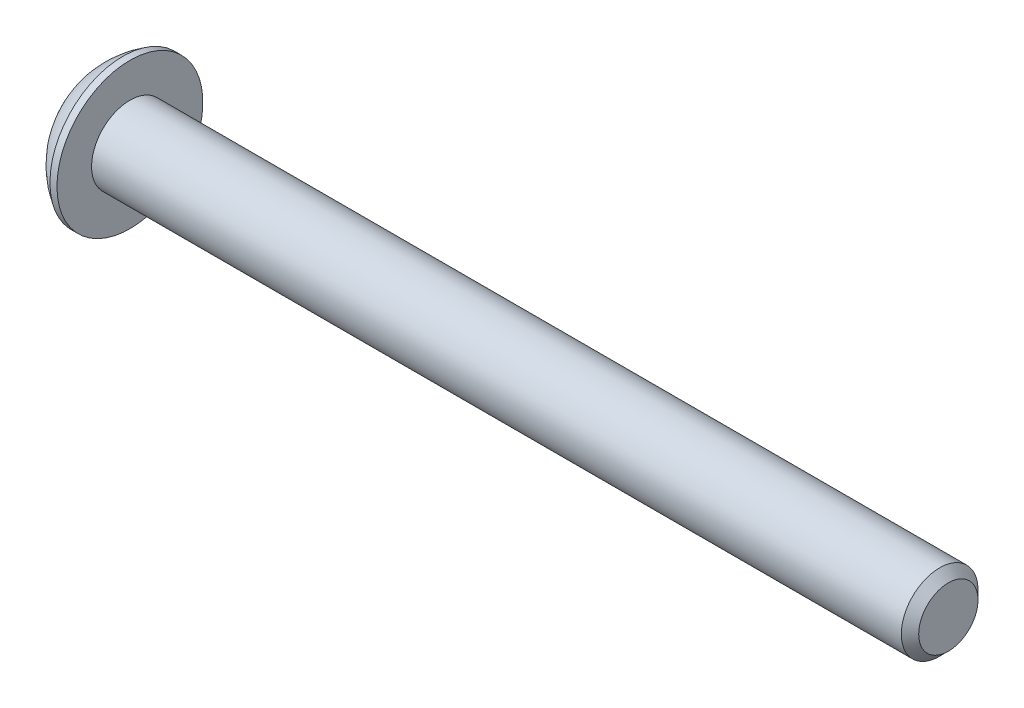
ISO-10303-21;
HEADER;
FILE_DESCRIPTION(('STEP AP214'),'2;1');
FILE_NAME('part.step','',(''),(''),'','','');
FILE_SCHEMA(('AUTOMOTIVE_DESIGN { 1 0 10303 214 1 1 1 1 }'));
ENDSEC;
DATA;
#1=APPLICATION_CONTEXT('core data for automotive mechanical design processes');
#2=APPLICATION_PROTOCOL_DEFINITION('international standard','automotive_design',2000,#1);
#3=PRODUCT_CONTEXT('',#1,'mechanical');
#4=PRODUCT('Part','Part','',(#3));
#5=PRODUCT_RELATED_PRODUCT_CATEGORY('part','',(#4));
#6=PRODUCT_DEFINITION_FORMATION('','',#4);
#7=PRODUCT_DEFINITION_CONTEXT('part definition',#1,'design');
#8=PRODUCT_DEFINITION('design','',#6,#7);
#9=PRODUCT_DEFINITION_SHAPE('','',#8);
#10=(LENGTH_UNIT() NAMED_UNIT(*) SI_UNIT(.MILLI.,.METRE.));
#11=(NAMED_UNIT(*) PLANE_ANGLE_UNIT() SI_UNIT($,.RADIAN.));
#12=(NAMED_UNIT(*) SI_UNIT($,.STERADIAN.) SOLID_ANGLE_UNIT());
#13=UNCERTAINTY_MEASURE_WITH_UNIT(LENGTH_MEASURE(1.E-05),#10,'distance_accuracy_value','');
#14=(GEOMETRIC_REPRESENTATION_CONTEXT(3) GLOBAL_UNCERTAINTY_ASSIGNED_CONTEXT((#13)) GLOBAL_UNIT_ASSIGNED_CONTEXT((#10,
#11,#12)) REPRESENTATION_CONTEXT('',''));
#15=CARTESIAN_POINT('',(0.,0.,0.));
#16=DIRECTION('',(0.,0.,1.));
#17=DIRECTION('',(1.,0.,0.));
#18=AXIS2_PLACEMENT_3D('',#15,#16,#17);
#19=CARTESIAN_POINT('',(1.32079999997359,0.,0.));
#20=DIRECTION('',(-1.,0.,0.));
#21=DIRECTION('',(0.,0.,1.));
#22=AXIS2_PLACEMENT_3D('',#19,#20,#21);
#23=CONICAL_SURFACE('',#22,1.19380000001001,1.04719755119008);
#24=CARTESIAN_POINT('',(2.0100407513155,0.,0.));
#25=VERTEX_POINT('',#24);
#26=VERTEX_LOOP('',#25);
#27=FACE_BOUND('',#26,.T.);
#28=CARTESIAN_POINT('',(1.32079999997359,0.,0.));
#29=DIRECTION('',(-1.,0.,0.));
#30=DIRECTION('',(0.,0.,1.));
#31=AXIS2_PLACEMENT_3D('',#28,#29,#30);
#32=CIRCLE('',#31,1.19380000001001);
#33=CARTESIAN_POINT('',(1.32079999998682,-1.0338611270422,0.596900000002503));
#34=VERTEX_POINT('',#33);
#35=CARTESIAN_POINT('',(1.32079999998682,0.,1.19380000000501));
#36=VERTEX_POINT('',#35);
#37=EDGE_CURVE('E92',#34,#36,#32,.T.);
#38=ORIENTED_EDGE('',*,*,#37,.T.);
#39=CARTESIAN_POINT('',(1.32079999997359,0.,0.));
#40=DIRECTION('',(-1.,0.,0.));
#41=DIRECTION('',(0.,0.,1.));
#42=AXIS2_PLACEMENT_3D('',#39,#40,#41);
#43=CIRCLE('',#42,1.19380000001001);
#44=CARTESIAN_POINT('',(1.32079999998682,1.0338611270422,0.596900000002504));
#45=VERTEX_POINT('',#44);
#46=EDGE_CURVE('E88',#36,#45,#43,.T.);
#47=ORIENTED_EDGE('',*,*,#46,.T.);
#48=CARTESIAN_POINT('',(1.32079999997359,0.,0.));
#49=DIRECTION('',(-1.,0.,0.));
#50=DIRECTION('',(0.,0.,1.));
#51=AXIS2_PLACEMENT_3D('',#48,#49,#50);
#52=CIRCLE('',#51,1.19380000001001);
#53=CARTESIAN_POINT('',(1.32079999998682,1.0338611270422,-0.596900000002504));
#54=VERTEX_POINT('',#53);
#55=EDGE_CURVE('E21',#45,#54,#52,.T.);
#56=ORIENTED_EDGE('',*,*,#55,.T.);
#57=CARTESIAN_POINT('',(1.32079999997359,0.,0.));
#58=DIRECTION('',(-1.,0.,0.));
#59=DIRECTION('',(0.,0.,1.));
#60=AXIS2_PLACEMENT_3D('',#57,#58,#59);
#61=CIRCLE('',#60,1.19380000001001);
#62=CARTESIAN_POINT('',(1.32079999998682,1.49461108489558E-12,-1.19380000000501));
#63=VERTEX_POINT('',#62);
#64=EDGE_CURVE('E151',#54,#63,#61,.T.);
#65=ORIENTED_EDGE('',*,*,#64,.T.);
#66=CARTESIAN_POINT('',(1.32079999997359,0.,0.));
#67=DIRECTION('',(-1.,0.,0.));
#68=DIRECTION('',(0.,0.,1.));
#69=AXIS2_PLACEMENT_3D('',#66,#67,#68);
#70=CIRCLE('',#69,1.19380000001001);
#71=CARTESIAN_POINT('',(1.32079999998682,-1.0338611270422,-0.596900000002503));
#72=VERTEX_POINT('',#71);
#73=EDGE_CURVE('E153',#63,#72,#70,.T.);
#74=ORIENTED_EDGE('',*,*,#73,.T.);
#75=CARTESIAN_POINT('',(1.32079999997359,0.,0.));
#76=DIRECTION('',(-1.,0.,0.));
#77=DIRECTION('',(0.,0.,1.));
#78=AXIS2_PLACEMENT_3D('',#75,#76,#77);
#79=CIRCLE('',#78,1.19380000001001);
#80=EDGE_CURVE('E155',#72,#34,#79,.T.);
#81=ORIENTED_EDGE('',*,*,#80,.T.);
#82=EDGE_LOOP('',(#38,#47,#56,#65,#74,#81));
#83=FACE_BOUND('',#82,.T.);
#84=ADVANCED_FACE('F17',(#27,#83),#23,.F.);
#85=CARTESIAN_POINT('',(1.3208,-2.06772225407572,-1.1938));
#86=DIRECTION('',(1.,0.,0.));
#87=DIRECTION('',(0.,0.,-1.));
#88=AXIS2_PLACEMENT_3D('',#85,#86,#87);
#89=PLANE('',#88);
#90=DIRECTION('',(0.,-0.5,-0.866025403784439));
#91=VECTOR('',#90,1.);
#92=CARTESIAN_POINT('',(1.32080000000004,1.37848150271715,0.));
#93=LINE('',#92,#91);
#94=CARTESIAN_POINT('',(1.32080000000001,1.37848150271715,0.));
#95=VERTEX_POINT('',#94);
#96=EDGE_CURVE('E104',#54,#95,#93,.F.);
#97=ORIENTED_EDGE('',*,*,#96,.F.);
#98=ORIENTED_EDGE('',*,*,#55,.F.);
#99=DIRECTION('',(0.,0.5,-0.866025403784439));
#100=VECTOR('',#99,1.);
#101=CARTESIAN_POINT('',(1.3208,0.689240751358576,1.1938));
#102=LINE('',#101,#100);
#103=EDGE_CURVE('E102',#95,#45,#102,.F.);
#104=ORIENTED_EDGE('',*,*,#103,.F.);
#105=EDGE_LOOP('',(#97,#98,#104));
#106=FACE_BOUND('',#105,.T.);
#107=ADVANCED_FACE('F100',(#106),#89,.F.);
#108=CARTESIAN_POINT('',(1.3208,-2.06772225407572,-1.1938));
#109=DIRECTION('',(1.,0.,0.));
#110=DIRECTION('',(0.,0.,-1.));
#111=AXIS2_PLACEMENT_3D('',#108,#109,#110);
#112=PLANE('',#111);
#113=DIRECTION('',(0.,0.5,-0.866025403784439));
#114=VECTOR('',#113,1.);
#115=CARTESIAN_POINT('',(1.32080000000004,0.689240751358576,1.1938));
#116=LINE('',#115,#114);
#117=CARTESIAN_POINT('',(1.32080000000001,0.689240751358576,1.1938));
#118=VERTEX_POINT('',#117);
#119=EDGE_CURVE('E106',#45,#118,#116,.F.);
#120=ORIENTED_EDGE('',*,*,#119,.F.);
#121=ORIENTED_EDGE('',*,*,#46,.F.);
#122=DIRECTION('',(0.,1.,0.));
#123=VECTOR('',#122,1.);
#124=CARTESIAN_POINT('',(1.3208,-0.689240751358574,1.1938));
#125=LINE('',#124,#123);
#126=EDGE_CURVE('E109',#118,#36,#125,.F.);
#127=ORIENTED_EDGE('',*,*,#126,.F.);
#128=EDGE_LOOP('',(#120,#121,#127));
#129=FACE_BOUND('',#128,.T.);
#130=ADVANCED_FACE('F107',(#129),#112,.F.);
#131=CARTESIAN_POINT('',(1.3208,-2.06772225407572,-1.1938));
#132=DIRECTION('',(1.,0.,0.));
#133=DIRECTION('',(0.,0.,-1.));
#134=AXIS2_PLACEMENT_3D('',#131,#132,#133);
#135=PLANE('',#134);
#136=DIRECTION('',(0.,1.,0.));
#137=VECTOR('',#136,1.);
#138=CARTESIAN_POINT('',(1.32080000000004,-0.689240751358574,1.1938));
#139=LINE('',#138,#137);
#140=CARTESIAN_POINT('',(1.32080000000001,-0.689240751358574,1.1938));
#141=VERTEX_POINT('',#140);
#142=EDGE_CURVE('E169',#36,#141,#139,.F.);
#143=ORIENTED_EDGE('',*,*,#142,.F.);
#144=ORIENTED_EDGE('',*,*,#37,.F.);
#145=DIRECTION('',(0.,0.5,0.866025403784439));
#146=VECTOR('',#145,1.);
#147=CARTESIAN_POINT('',(1.3208,-1.37848150271715,0.));
#148=LINE('',#147,#146);
#149=EDGE_CURVE('E167',#141,#34,#148,.F.);
#150=ORIENTED_EDGE('',*,*,#149,.F.);
#151=EDGE_LOOP('',(#143,#144,#150));
#152=FACE_BOUND('',#151,.T.);
#153=ADVANCED_FACE('F165',(#152),#135,.F.);
#154=CARTESIAN_POINT('',(1.3208,-2.06772225407572,-1.1938));
#155=DIRECTION('',(1.,0.,0.));
#156=DIRECTION('',(0.,0.,-1.));
#157=AXIS2_PLACEMENT_3D('',#154,#155,#156);
#158=PLANE('',#157);
#159=DIRECTION('',(0.,0.5,0.866025403784439));
#160=VECTOR('',#159,1.);
#161=CARTESIAN_POINT('',(1.32080000000004,-1.37848150271715,0.));
#162=LINE('',#161,#160);
#163=CARTESIAN_POINT('',(1.32080000000001,-1.37848150271715,0.));
#164=VERTEX_POINT('',#163);
#165=EDGE_CURVE('E170',#34,#164,#162,.F.);
#166=ORIENTED_EDGE('',*,*,#165,.F.);
#167=ORIENTED_EDGE('',*,*,#80,.F.);
#168=DIRECTION('',(0.,-0.5,0.866025403784439));
#169=VECTOR('',#168,1.);
#170=CARTESIAN_POINT('',(1.3208,-0.689240751358574,-1.1938));
#171=LINE('',#170,#169);
#172=EDGE_CURVE('E173',#164,#72,#171,.F.);
#173=ORIENTED_EDGE('',*,*,#172,.F.);
#174=EDGE_LOOP('',(#166,#167,#173));
#175=FACE_BOUND('',#174,.T.);
#176=ADVANCED_FACE('F171',(#175),#158,.F.);
#177=CARTESIAN_POINT('',(1.3208,-2.06772225407572,-1.1938));
#178=DIRECTION('',(1.,0.,0.));
#179=DIRECTION('',(0.,0.,-1.));
#180=AXIS2_PLACEMENT_3D('',#177,#178,#179);
#181=PLANE('',#180);
#182=DIRECTION('',(0.,-0.5,0.866025403784439));
#183=VECTOR('',#182,1.);
#184=CARTESIAN_POINT('',(1.32080000000004,-0.689240751358574,-1.1938));
#185=LINE('',#184,#183);
#186=CARTESIAN_POINT('',(1.32080000000001,-0.689240751358574,-1.1938));
#187=VERTEX_POINT('',#186);
#188=EDGE_CURVE('E228',#72,#187,#185,.F.);
#189=ORIENTED_EDGE('',*,*,#188,.F.);
#190=ORIENTED_EDGE('',*,*,#73,.F.);
#191=DIRECTION('',(0.,1.,0.));
#192=VECTOR('',#191,1.);
#193=CARTESIAN_POINT('',(1.3208,0.689240751358577,-1.1938));
#194=LINE('',#193,#192);
#195=EDGE_CURVE('E240',#187,#63,#194,.T.);
#196=ORIENTED_EDGE('',*,*,#195,.F.);
#197=EDGE_LOOP('',(#189,#190,#196));
#198=FACE_BOUND('',#197,.T.);
#199=ADVANCED_FACE('F390',(#198),#181,.F.);
#200=CARTESIAN_POINT('',(1.3208,-2.06772225407572,-1.1938));
#201=DIRECTION('',(1.,0.,0.));
#202=DIRECTION('',(0.,0.,-1.));
#203=AXIS2_PLACEMENT_3D('',#200,#201,#202);
#204=PLANE('',#203);
#205=DIRECTION('',(0.,1.,0.));
#206=VECTOR('',#205,1.);
#207=CARTESIAN_POINT('',(1.32080000000004,0.689240751358577,-1.1938));
#208=LINE('',#207,#206);
#209=CARTESIAN_POINT('',(1.32080000000002,0.689240751358565,-1.19380000000002));
#210=VERTEX_POINT('',#209);
#211=EDGE_CURVE('E248',#63,#210,#208,.T.);
#212=ORIENTED_EDGE('',*,*,#211,.F.);
#213=ORIENTED_EDGE('',*,*,#64,.F.);
#214=DIRECTION('',(0.,-0.5,-0.866025403784439));
#215=VECTOR('',#214,1.);
#216=CARTESIAN_POINT('',(1.3208,1.37848150271715,0.));
#217=LINE('',#216,#215);
#218=EDGE_CURVE('E128',#210,#54,#217,.F.);
#219=ORIENTED_EDGE('',*,*,#218,.F.);
#220=EDGE_LOOP('',(#212,#213,#219));
#221=FACE_BOUND('',#220,.T.);
#222=ADVANCED_FACE('F380',(#221),#204,.F.);
#223=CARTESIAN_POINT('',(1.3208,1.37848150271715,0.));
#224=DIRECTION('',(0.,-0.866025403784439,0.5));
#225=DIRECTION('',(0.,-0.5,-0.866025403784439));
#226=AXIS2_PLACEMENT_3D('',#223,#224,#225);
#227=PLANE('',#226);
#228=ORIENTED_EDGE('',*,*,#96,.T.);
#229=DIRECTION('',(1.,0.,0.));
#230=VECTOR('',#229,1.);
#231=CARTESIAN_POINT('',(1.3208,1.37848150271715,0.));
#232=LINE('',#231,#230);
#233=CARTESIAN_POINT('',(0.,1.37848150271715,0.));
#234=VERTEX_POINT('',#233);
#235=EDGE_CURVE('E116',#234,#95,#232,.T.);
#236=ORIENTED_EDGE('',*,*,#235,.F.);
#237=DIRECTION('',(0.,0.5,0.866025403784439));
#238=VECTOR('',#237,1.);
#239=CARTESIAN_POINT('',(0.,0.689240751358577,-1.1938));
#240=LINE('',#239,#238);
#241=CARTESIAN_POINT('',(0.,0.689240751358577,-1.1938));
#242=VERTEX_POINT('',#241);
#243=EDGE_CURVE('E131',#242,#234,#240,.T.);
#244=ORIENTED_EDGE('',*,*,#243,.F.);
#245=DIRECTION('',(1.,0.,0.));
#246=VECTOR('',#245,1.);
#247=CARTESIAN_POINT('',(1.3208,0.689240751358577,-1.1938));
#248=LINE('',#247,#246);
#249=EDGE_CURVE('E135',#210,#242,#248,.F.);
#250=ORIENTED_EDGE('',*,*,#249,.F.);
#251=ORIENTED_EDGE('',*,*,#218,.T.);
#252=EDGE_LOOP('',(#228,#236,#244,#250,#251));
#253=FACE_BOUND('',#252,.T.);
#254=ADVANCED_FACE('F371',(#253),#227,.T.);
#255=CARTESIAN_POINT('',(1.3208,0.689240751358576,1.1938));
#256=DIRECTION('',(0.,-0.866025403784439,-0.5));
#257=DIRECTION('',(0.,0.5,-0.866025403784439));
#258=AXIS2_PLACEMENT_3D('',#255,#256,#257);
#259=PLANE('',#258);
#260=ORIENTED_EDGE('',*,*,#119,.T.);
#261=DIRECTION('',(1.,0.,0.));
#262=VECTOR('',#261,1.);
#263=CARTESIAN_POINT('',(1.3208,0.689240751358576,1.1938));
#264=LINE('',#263,#262);
#265=CARTESIAN_POINT('',(0.,0.689240751358577,1.1938));
#266=VERTEX_POINT('',#265);
#267=EDGE_CURVE('E112',#266,#118,#264,.T.);
#268=ORIENTED_EDGE('',*,*,#267,.F.);
#269=DIRECTION('',(0.,-0.5,0.866025403784439));
#270=VECTOR('',#269,1.);
#271=CARTESIAN_POINT('',(0.,1.37848150271715,0.));
#272=LINE('',#271,#270);
#273=EDGE_CURVE('E134',#234,#266,#272,.T.);
#274=ORIENTED_EDGE('',*,*,#273,.F.);
#275=ORIENTED_EDGE('',*,*,#235,.T.);
#276=ORIENTED_EDGE('',*,*,#103,.T.);
#277=EDGE_LOOP('',(#260,#268,#274,#275,#276));
#278=FACE_BOUND('',#277,.T.);
#279=ADVANCED_FACE('F114',(#278),#259,.T.);
#280=CARTESIAN_POINT('',(1.3208,-0.689240751358574,1.1938));
#281=DIRECTION('',(0.,0.,-1.));
#282=DIRECTION('',(0.,1.,0.));
#283=AXIS2_PLACEMENT_3D('',#280,#281,#282);
#284=PLANE('',#283);
#285=ORIENTED_EDGE('',*,*,#142,.T.);
#286=DIRECTION('',(1.,0.,0.));
#287=VECTOR('',#286,1.);
#288=CARTESIAN_POINT('',(1.3208,-0.689240751358574,1.1938));
#289=LINE('',#288,#287);
#290=CARTESIAN_POINT('',(0.,-0.689240751358574,1.1938));
#291=VERTEX_POINT('',#290);
#292=EDGE_CURVE('E180',#291,#141,#289,.T.);
#293=ORIENTED_EDGE('',*,*,#292,.F.);
#294=DIRECTION('',(0.,1.,0.));
#295=VECTOR('',#294,1.);
#296=CARTESIAN_POINT('',(0.,0.,1.1938));
#297=LINE('',#296,#295);
#298=EDGE_CURVE('E194',#266,#291,#297,.F.);
#299=ORIENTED_EDGE('',*,*,#298,.F.);
#300=ORIENTED_EDGE('',*,*,#267,.T.);
#301=ORIENTED_EDGE('',*,*,#126,.T.);
#302=EDGE_LOOP('',(#285,#293,#299,#300,#301));
#303=FACE_BOUND('',#302,.T.);
#304=ADVANCED_FACE('F216',(#303),#284,.T.);
#305=CARTESIAN_POINT('',(1.3208,-1.37848150271715,0.));
#306=DIRECTION('',(0.,0.866025403784439,-0.5));
#307=DIRECTION('',(0.,0.5,0.866025403784439));
#308=AXIS2_PLACEMENT_3D('',#305,#306,#307);
#309=PLANE('',#308);
#310=ORIENTED_EDGE('',*,*,#165,.T.);
#311=DIRECTION('',(1.,0.,0.));
#312=VECTOR('',#311,1.);
#313=CARTESIAN_POINT('',(1.3208,-1.37848150271715,0.));
#314=LINE('',#313,#312);
#315=CARTESIAN_POINT('',(0.,-1.37848150271715,0.));
#316=VERTEX_POINT('',#315);
#317=EDGE_CURVE('E176',#316,#164,#314,.T.);
#318=ORIENTED_EDGE('',*,*,#317,.F.);
#319=DIRECTION('',(0.,-0.5,-0.866025403784439));
#320=VECTOR('',#319,1.);
#321=CARTESIAN_POINT('',(0.,-0.689240751358574,1.1938));
#322=LINE('',#321,#320);
#323=EDGE_CURVE('E197',#291,#316,#322,.T.);
#324=ORIENTED_EDGE('',*,*,#323,.F.);
#325=ORIENTED_EDGE('',*,*,#292,.T.);
#326=ORIENTED_EDGE('',*,*,#149,.T.);
#327=EDGE_LOOP('',(#310,#318,#324,#325,#326));
#328=FACE_BOUND('',#327,.T.);
#329=ADVANCED_FACE('F178',(#328),#309,.T.);
#330=CARTESIAN_POINT('',(1.3208,-0.689240751358574,-1.1938));
#331=DIRECTION('',(0.,0.866025403784439,0.5));
#332=DIRECTION('',(0.,-0.5,0.866025403784439));
#333=AXIS2_PLACEMENT_3D('',#330,#331,#332);
#334=PLANE('',#333);
#335=ORIENTED_EDGE('',*,*,#188,.T.);
#336=DIRECTION('',(1.,0.,0.));
#337=VECTOR('',#336,1.);
#338=CARTESIAN_POINT('',(1.3208,-0.689240751358574,-1.1938));
#339=LINE('',#338,#337);
#340=CARTESIAN_POINT('',(0.,-0.689240751358574,-1.1938));
#341=VERTEX_POINT('',#340);
#342=EDGE_CURVE('E36',#341,#187,#339,.T.);
#343=ORIENTED_EDGE('',*,*,#342,.F.);
#344=DIRECTION('',(0.,0.5,-0.866025403784439));
#345=VECTOR('',#344,1.);
#346=CARTESIAN_POINT('',(0.,-1.37848150271715,0.));
#347=LINE('',#346,#345);
#348=EDGE_CURVE('E217',#316,#341,#347,.T.);
#349=ORIENTED_EDGE('',*,*,#348,.F.);
#350=ORIENTED_EDGE('',*,*,#317,.T.);
#351=ORIENTED_EDGE('',*,*,#172,.T.);
#352=EDGE_LOOP('',(#335,#343,#349,#350,#351));
#353=FACE_BOUND('',#352,.T.);
#354=ADVANCED_FACE('F337',(#353),#334,.T.);
#355=CARTESIAN_POINT('',(1.3208,0.689240751358577,-1.1938));
#356=DIRECTION('',(0.,0.,1.));
#357=DIRECTION('',(1.,0.,0.));
#358=AXIS2_PLACEMENT_3D('',#355,#356,#357);
#359=PLANE('',#358);
#360=ORIENTED_EDGE('',*,*,#211,.T.);
#361=ORIENTED_EDGE('',*,*,#249,.T.);
#362=DIRECTION('',(0.,1.,0.));
#363=VECTOR('',#362,1.);
#364=CARTESIAN_POINT('',(0.,0.,-1.1938));
#365=LINE('',#364,#363);
#366=EDGE_CURVE('E150',#341,#242,#365,.T.);
#367=ORIENTED_EDGE('',*,*,#366,.F.);
#368=ORIENTED_EDGE('',*,*,#342,.T.);
#369=ORIENTED_EDGE('',*,*,#195,.T.);
#370=EDGE_LOOP('',(#360,#361,#367,#368,#369));
#371=FACE_BOUND('',#370,.T.);
#372=ADVANCED_FACE('F328',(#371),#359,.T.);
#373=CARTESIAN_POINT('',(0.,0.,0.));
#374=DIRECTION('',(-1.,0.,0.));
#375=DIRECTION('',(0.,0.,1.));
#376=AXIS2_PLACEMENT_3D('',#373,#374,#375);
#377=PLANE('',#376);
#378=CARTESIAN_POINT('',(0.,0.,0.));
#379=DIRECTION('',(-1.,0.,0.));
#380=DIRECTION('',(0.,0.,1.));
#381=AXIS2_PLACEMENT_3D('',#378,#379,#380);
#382=CIRCLE('',#381,1.9812);
#383=CARTESIAN_POINT('',(0.,0.,1.9812));
#384=VERTEX_POINT('',#383);
#385=EDGE_CURVE('E147',#384,#384,#382,.F.);
#386=ORIENTED_EDGE('',*,*,#385,.F.);
#387=EDGE_LOOP('',(#386));
#388=FACE_BOUND('',#387,.T.);
#389=ORIENTED_EDGE('',*,*,#348,.T.);
#390=ORIENTED_EDGE('',*,*,#366,.T.);
#391=ORIENTED_EDGE('',*,*,#243,.T.);
#392=ORIENTED_EDGE('',*,*,#273,.T.);
#393=ORIENTED_EDGE('',*,*,#298,.T.);
#394=ORIENTED_EDGE('',*,*,#323,.T.);
#395=EDGE_LOOP('',(#389,#390,#391,#392,#393,#394));
#396=FACE_BOUND('',#395,.T.);
#397=ADVANCED_FACE('F210',(#388,#396),#377,.T.);
#398=CARTESIAN_POINT('',(4.13385,0.,0.));
#399=DIRECTION('',(0.,1.,0.));
#400=DIRECTION('',(-0.489667403954941,0.,-0.871909303485189));
#401=AXIS2_PLACEMENT_3D('',#398,#399,#400);
#402=SPHERICAL_SURFACE('',#401,4.58408870578439);
#403=CARTESIAN_POINT('',(4.13385,0.,0.));
#404=DIRECTION('',(-1.,0.,0.));
#405=DIRECTION('',(0.,0.,1.));
#406=AXIS2_PLACEMENT_3D('',#403,#404,#405);
#407=SPHERICAL_SURFACE('',#406,4.58408870578439);
#408=ORIENTED_EDGE('',*,*,#385,.T.);
#409=EDGE_LOOP('',(#408));
#410=FACE_BOUND('',#409,.T.);
#411=CARTESIAN_POINT('',(1.8288,0.,0.));
#412=DIRECTION('',(-1.,0.,0.));
#413=DIRECTION('',(0.,0.,1.));
#414=AXIS2_PLACEMENT_3D('',#411,#412,#413);
#415=CIRCLE('',#414,3.9624);
#416=CARTESIAN_POINT('',(1.8288,0.,3.9624));
#417=VERTEX_POINT('',#416);
#418=EDGE_CURVE('E144',#417,#417,#415,.F.);
#419=ORIENTED_EDGE('',*,*,#418,.F.);
#420=EDGE_LOOP('',(#419));
#421=FACE_BOUND('',#420,.T.);
#422=ADVANCED_FACE('F19',(#410,#421),#407,.T.);
#423=CARTESIAN_POINT('',(46.6598,0.,0.));
#424=DIRECTION('',(-1.,0.,0.));
#425=DIRECTION('',(0.,0.,1.));
#426=AXIS2_PLACEMENT_3D('',#423,#424,#425);
#427=PLANE('',#426);
#428=CARTESIAN_POINT('',(46.6598000000431,0.,0.));
#429=DIRECTION('',(-1.,0.,0.));
#430=DIRECTION('',(0.,0.,1.));
#431=AXIS2_PLACEMENT_3D('',#428,#429,#430);
#432=CIRCLE('',#431,1.61035999997239);
#433=CARTESIAN_POINT('',(46.6598000000431,0.,1.61035999997239));
#434=VERTEX_POINT('',#433);
#435=EDGE_CURVE('E141',#434,#434,#432,.T.);
#436=ORIENTED_EDGE('',*,*,#435,.F.);
#437=EDGE_LOOP('',(#436));
#438=FACE_BOUND('',#437,.T.);
#439=ADVANCED_FACE('F270',(#438),#427,.F.);
#440=CARTESIAN_POINT('',(0.,0.,0.));
#441=DIRECTION('',(-1.,0.,0.));
#442=DIRECTION('',(0.,0.,1.));
#443=AXIS2_PLACEMENT_3D('',#440,#441,#442);
#444=CYLINDRICAL_SURFACE('',#443,3.9624);
#445=ORIENTED_EDGE('',*,*,#418,.T.);
#446=EDGE_LOOP('',(#445));
#447=FACE_BOUND('',#446,.T.);
#448=CARTESIAN_POINT('',(2.2098,0.,0.));
#449=DIRECTION('',(-1.,0.,0.));
#450=DIRECTION('',(0.,0.,1.));
#451=AXIS2_PLACEMENT_3D('',#448,#449,#450);
#452=CIRCLE('',#451,3.9624);
#453=CARTESIAN_POINT('',(2.2098,0.,3.9624));
#454=VERTEX_POINT('',#453);
#455=EDGE_CURVE('E138',#454,#454,#452,.T.);
#456=ORIENTED_EDGE('',*,*,#455,.T.);
#457=EDGE_LOOP('',(#456));
#458=FACE_BOUND('',#457,.T.);
#459=ADVANCED_FACE('F266',(#447,#458),#444,.T.);
#460=CARTESIAN_POINT('',(46.1873600000331,0.,0.));
#461=DIRECTION('',(-1.,0.,0.));
#462=DIRECTION('',(0.,0.,1.));
#463=AXIS2_PLACEMENT_3D('',#460,#461,#462);
#464=CONICAL_SURFACE('',#463,2.0827999999824,0.785398163397448);
#465=CARTESIAN_POINT('',(46.18736,0.,0.));
#466=DIRECTION('',(-1.,0.,0.));
#467=DIRECTION('',(0.,0.,1.));
#468=AXIS2_PLACEMENT_3D('',#465,#466,#467);
#469=CIRCLE('',#468,2.0828);
#470=CARTESIAN_POINT('',(46.18736,0.,2.0828));
#471=VERTEX_POINT('',#470);
#472=EDGE_CURVE('E27',#471,#471,#469,.T.);
#473=ORIENTED_EDGE('',*,*,#472,.F.);
#474=EDGE_LOOP('',(#473));
#475=FACE_BOUND('',#474,.T.);
#476=ORIENTED_EDGE('',*,*,#435,.T.);
#477=EDGE_LOOP('',(#476));
#478=FACE_BOUND('',#477,.T.);
#479=ADVANCED_FACE('F262',(#475,#478),#464,.T.);
#480=CARTESIAN_POINT('',(2.2098,2.0828,0.));
#481=DIRECTION('',(-1.,0.,0.));
#482=DIRECTION('',(0.,0.,1.));
#483=AXIS2_PLACEMENT_3D('',#480,#481,#482);
#484=PLANE('',#483);
#485=ORIENTED_EDGE('',*,*,#455,.F.);
#486=EDGE_LOOP('',(#485));
#487=FACE_BOUND('',#486,.T.);
#488=CARTESIAN_POINT('',(2.2098,0.,0.));
#489=DIRECTION('',(-1.,0.,0.));
#490=DIRECTION('',(0.,0.,1.));
#491=AXIS2_PLACEMENT_3D('',#488,#489,#490);
#492=CIRCLE('',#491,2.0828);
#493=CARTESIAN_POINT('',(2.2098,0.,2.0828));
#494=VERTEX_POINT('',#493);
#495=EDGE_CURVE('E11',#494,#494,#492,.F.);
#496=ORIENTED_EDGE('',*,*,#495,.F.);
#497=EDGE_LOOP('',(#496));
#498=FACE_BOUND('',#497,.T.);
#499=ADVANCED_FACE('F265',(#487,#498),#484,.F.);
#500=CARTESIAN_POINT('',(0.,0.,0.));
#501=DIRECTION('',(-1.,0.,0.));
#502=DIRECTION('',(0.,0.,1.));
#503=AXIS2_PLACEMENT_3D('',#500,#501,#502);
#504=CYLINDRICAL_SURFACE('',#503,2.0828);
#505=ORIENTED_EDGE('',*,*,#495,.T.);
#506=EDGE_LOOP('',(#505));
#507=FACE_BOUND('',#506,.T.);
#508=ORIENTED_EDGE('',*,*,#472,.T.);
#509=EDGE_LOOP('',(#508));
#510=FACE_BOUND('',#509,.T.);
#511=ADVANCED_FACE('F260',(#507,#510),#504,.T.);
#512=CLOSED_SHELL('',(#84,#107,#130,#153,#176,#199,#222,#254,#279,#304,#329,#354,#372,#397,#422,
#439,#459,#479,#499,#511));
#513=MANIFOLD_SOLID_BREP('B1',#512);
#514=ADVANCED_BREP_SHAPE_REPRESENTATION('',(#18,#513),#14);
#515=SHAPE_DEFINITION_REPRESENTATION(#9,#514);
ENDSEC;
END-ISO-10303-21;
